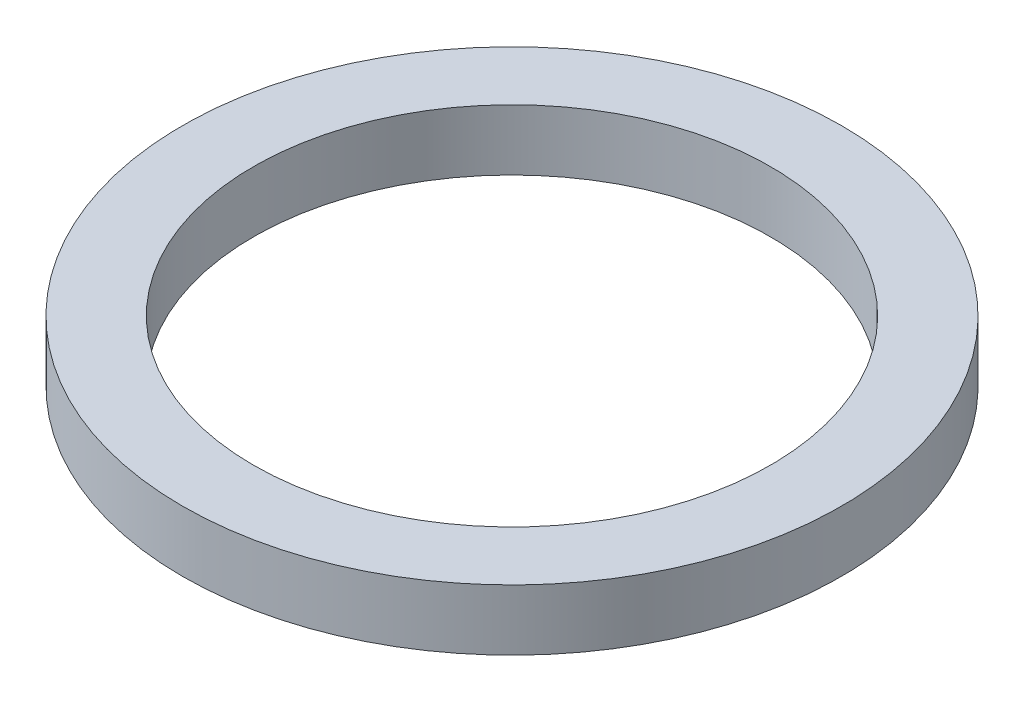
ISO-10303-21;
HEADER;
FILE_DESCRIPTION(('STEP AP214'),'2;1');
FILE_NAME('part.step','',(''),(''),'','','');
FILE_SCHEMA(('AUTOMOTIVE_DESIGN { 1 0 10303 214 1 1 1 1 }'));
ENDSEC;
DATA;
#1=APPLICATION_CONTEXT('core data for automotive mechanical design processes');
#2=APPLICATION_PROTOCOL_DEFINITION('international standard','automotive_design',2000,#1);
#3=PRODUCT_CONTEXT('',#1,'mechanical');
#4=PRODUCT('Part','Part','',(#3));
#5=PRODUCT_RELATED_PRODUCT_CATEGORY('part','',(#4));
#6=PRODUCT_DEFINITION_FORMATION('','',#4);
#7=PRODUCT_DEFINITION_CONTEXT('part definition',#1,'design');
#8=PRODUCT_DEFINITION('design','',#6,#7);
#9=PRODUCT_DEFINITION_SHAPE('','',#8);
#10=(LENGTH_UNIT() NAMED_UNIT(*) SI_UNIT(.MILLI.,.METRE.));
#11=(NAMED_UNIT(*) PLANE_ANGLE_UNIT() SI_UNIT($,.RADIAN.));
#12=(NAMED_UNIT(*) SI_UNIT($,.STERADIAN.) SOLID_ANGLE_UNIT());
#13=UNCERTAINTY_MEASURE_WITH_UNIT(LENGTH_MEASURE(1.E-05),#10,'distance_accuracy_value','');
#14=(GEOMETRIC_REPRESENTATION_CONTEXT(3) GLOBAL_UNCERTAINTY_ASSIGNED_CONTEXT((#13)) GLOBAL_UNIT_ASSIGNED_CONTEXT((#10,
#11,#12)) REPRESENTATION_CONTEXT('',''));
#15=CARTESIAN_POINT('',(0.,0.,0.));
#16=DIRECTION('',(0.,0.,1.));
#17=DIRECTION('',(1.,0.,0.));
#18=AXIS2_PLACEMENT_3D('',#15,#16,#17);
#19=CARTESIAN_POINT('',(0.,6.,0.));
#20=DIRECTION('',(0.,1.,0.));
#21=DIRECTION('',(0.,0.,1.));
#22=AXIS2_PLACEMENT_3D('',#19,#20,#21);
#23=PLANE('',#22);
#24=CARTESIAN_POINT('',(0.,6.,0.));
#25=DIRECTION('',(0.,1.,0.));
#26=DIRECTION('',(0.,0.,1.));
#27=AXIS2_PLACEMENT_3D('',#24,#25,#26);
#28=CIRCLE('',#27,32.5);
#29=CARTESIAN_POINT('',(0.,6.,32.5));
#30=VERTEX_POINT('',#29);
#31=EDGE_CURVE('E10',#30,#30,#28,.T.);
#32=ORIENTED_EDGE('',*,*,#31,.T.);
#33=EDGE_LOOP('',(#32));
#34=FACE_BOUND('',#33,.T.);
#35=CARTESIAN_POINT('',(0.,6.,0.));
#36=DIRECTION('',(0.,1.,0.));
#37=DIRECTION('',(0.,0.,1.));
#38=AXIS2_PLACEMENT_3D('',#35,#36,#37);
#39=CIRCLE('',#38,25.5);
#40=CARTESIAN_POINT('',(0.,6.,25.5));
#41=VERTEX_POINT('',#40);
#42=EDGE_CURVE('E44',#41,#41,#39,.T.);
#43=ORIENTED_EDGE('',*,*,#42,.F.);
#44=EDGE_LOOP('',(#43));
#45=FACE_BOUND('',#44,.T.);
#46=ADVANCED_FACE('F33',(#34,#45),#23,.T.);
#47=CARTESIAN_POINT('',(0.,0.,0.));
#48=DIRECTION('',(0.,1.,0.));
#49=DIRECTION('',(0.,0.,1.));
#50=AXIS2_PLACEMENT_3D('',#47,#48,#49);
#51=PLANE('',#50);
#52=CARTESIAN_POINT('',(0.,0.,0.));
#53=DIRECTION('',(0.,1.,0.));
#54=DIRECTION('',(0.,0.,1.));
#55=AXIS2_PLACEMENT_3D('',#52,#53,#54);
#56=CIRCLE('',#55,32.5);
#57=CARTESIAN_POINT('',(0.,0.,32.5));
#58=VERTEX_POINT('',#57);
#59=EDGE_CURVE('E37',#58,#58,#56,.T.);
#60=ORIENTED_EDGE('',*,*,#59,.F.);
#61=EDGE_LOOP('',(#60));
#62=FACE_BOUND('',#61,.T.);
#63=CARTESIAN_POINT('',(0.,0.,0.));
#64=DIRECTION('',(0.,1.,0.));
#65=DIRECTION('',(0.,0.,1.));
#66=AXIS2_PLACEMENT_3D('',#63,#64,#65);
#67=CIRCLE('',#66,25.5);
#68=CARTESIAN_POINT('',(0.,0.,25.5));
#69=VERTEX_POINT('',#68);
#70=EDGE_CURVE('E46',#69,#69,#67,.T.);
#71=ORIENTED_EDGE('',*,*,#70,.T.);
#72=EDGE_LOOP('',(#71));
#73=FACE_BOUND('',#72,.T.);
#74=ADVANCED_FACE('F56',(#62,#73),#51,.F.);
#75=CARTESIAN_POINT('',(0.,6.,0.));
#76=DIRECTION('',(0.,-1.,0.));
#77=DIRECTION('',(0.,0.,-1.));
#78=AXIS2_PLACEMENT_3D('',#75,#76,#77);
#79=CYLINDRICAL_SURFACE('',#78,32.5);
#80=ORIENTED_EDGE('',*,*,#31,.F.);
#81=EDGE_LOOP('',(#80));
#82=FACE_BOUND('',#81,.T.);
#83=ORIENTED_EDGE('',*,*,#59,.T.);
#84=EDGE_LOOP('',(#83));
#85=FACE_BOUND('',#84,.T.);
#86=ADVANCED_FACE('F35',(#82,#85),#79,.T.);
#87=CARTESIAN_POINT('',(0.,6.,0.));
#88=DIRECTION('',(0.,-1.,0.));
#89=DIRECTION('',(0.,0.,-1.));
#90=AXIS2_PLACEMENT_3D('',#87,#88,#89);
#91=CYLINDRICAL_SURFACE('',#90,25.5);
#92=ORIENTED_EDGE('',*,*,#42,.T.);
#93=EDGE_LOOP('',(#92));
#94=FACE_BOUND('',#93,.T.);
#95=ORIENTED_EDGE('',*,*,#70,.F.);
#96=EDGE_LOOP('',(#95));
#97=FACE_BOUND('',#96,.T.);
#98=ADVANCED_FACE('F52',(#94,#97),#91,.F.);
#99=CLOSED_SHELL('',(#46,#74,#86,#98));
#100=MANIFOLD_SOLID_BREP('B2',#99);
#101=ADVANCED_BREP_SHAPE_REPRESENTATION('',(#18,#100),#14);
#102=SHAPE_DEFINITION_REPRESENTATION(#9,#101);
ENDSEC;
END-ISO-10303-21;
